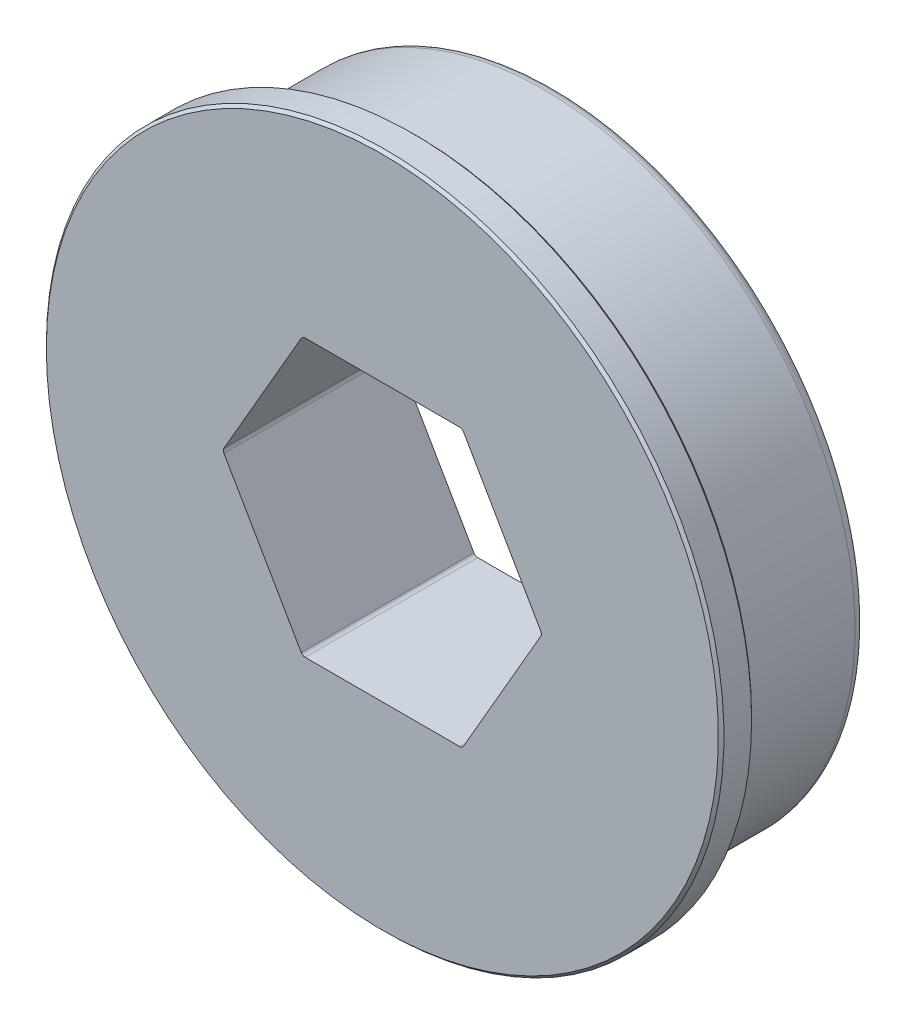
ISO-10303-21;
HEADER;
FILE_DESCRIPTION(('STEP AP214'),'2;1');
FILE_NAME('part.step','',(''),(''),'','','');
FILE_SCHEMA(('AUTOMOTIVE_DESIGN { 1 0 10303 214 1 1 1 1 }'));
ENDSEC;
DATA;
#1=APPLICATION_CONTEXT('core data for automotive mechanical design processes');
#2=APPLICATION_PROTOCOL_DEFINITION('international standard','automotive_design',2000,#1);
#3=PRODUCT_CONTEXT('',#1,'mechanical');
#4=PRODUCT('Part','Part','',(#3));
#5=PRODUCT_RELATED_PRODUCT_CATEGORY('part','',(#4));
#6=PRODUCT_DEFINITION_FORMATION('','',#4);
#7=PRODUCT_DEFINITION_CONTEXT('part definition',#1,'design');
#8=PRODUCT_DEFINITION('design','',#6,#7);
#9=PRODUCT_DEFINITION_SHAPE('','',#8);
#10=(LENGTH_UNIT() NAMED_UNIT(*) SI_UNIT(.MILLI.,.METRE.));
#11=(NAMED_UNIT(*) PLANE_ANGLE_UNIT() SI_UNIT($,.RADIAN.));
#12=(NAMED_UNIT(*) SI_UNIT($,.STERADIAN.) SOLID_ANGLE_UNIT());
#13=UNCERTAINTY_MEASURE_WITH_UNIT(LENGTH_MEASURE(1.E-05),#10,'distance_accuracy_value','');
#14=(GEOMETRIC_REPRESENTATION_CONTEXT(3) GLOBAL_UNCERTAINTY_ASSIGNED_CONTEXT((#13)) GLOBAL_UNIT_ASSIGNED_CONTEXT((#10,
#11,#12)) REPRESENTATION_CONTEXT('',''));
#15=CARTESIAN_POINT('',(0.,0.,0.));
#16=DIRECTION('',(0.,0.,1.));
#17=DIRECTION('',(1.,0.,0.));
#18=AXIS2_PLACEMENT_3D('',#15,#16,#17);
#19=CARTESIAN_POINT('',(0.,0.,7.92734));
#20=DIRECTION('',(0.,0.,-1.));
#21=DIRECTION('',(-1.,0.,0.));
#22=AXIS2_PLACEMENT_3D('',#19,#20,#21);
#23=CYLINDRICAL_SURFACE('',#22,13.97);
#24=CARTESIAN_POINT('',(0.,0.,6.40333999999999));
#25=DIRECTION('',(0.,0.,-1.));
#26=DIRECTION('',(-1.,0.,0.));
#27=AXIS2_PLACEMENT_3D('',#24,#25,#26);
#28=CIRCLE('',#27,13.97);
#29=CARTESIAN_POINT('',(-13.97,0.,6.40333999999999));
#30=VERTEX_POINT('',#29);
#31=EDGE_CURVE('E256',#30,#30,#28,.F.);
#32=ORIENTED_EDGE('',*,*,#31,.F.);
#33=EDGE_LOOP('',(#32));
#34=FACE_BOUND('',#33,.T.);
#35=CARTESIAN_POINT('',(0.,0.,5.89534));
#36=DIRECTION('',(0.,0.,-1.));
#37=DIRECTION('',(-1.,0.,0.));
#38=AXIS2_PLACEMENT_3D('',#35,#36,#37);
#39=CIRCLE('',#38,13.97);
#40=CARTESIAN_POINT('',(-13.97,0.,5.89534));
#41=VERTEX_POINT('',#40);
#42=EDGE_CURVE('E259',#41,#41,#39,.T.);
#43=ORIENTED_EDGE('',*,*,#42,.F.);
#44=EDGE_LOOP('',(#43));
#45=FACE_BOUND('',#44,.T.);
#46=ADVANCED_FACE('F18',(#34,#45),#23,.T.);
#47=CARTESIAN_POINT('',(14.2875,0.,5.89534));
#48=DIRECTION('',(0.,0.,1.));
#49=DIRECTION('',(1.,0.,0.));
#50=AXIS2_PLACEMENT_3D('',#47,#48,#49);
#51=PLANE('',#50);
#52=CARTESIAN_POINT('',(0.,0.,5.89534));
#53=DIRECTION('',(0.,0.,-1.));
#54=DIRECTION('',(-1.,0.,0.));
#55=AXIS2_PLACEMENT_3D('',#52,#53,#54);
#56=CIRCLE('',#55,14.2875);
#57=CARTESIAN_POINT('',(-14.2875,0.,5.89534));
#58=VERTEX_POINT('',#57);
#59=EDGE_CURVE('E253',#58,#58,#56,.T.);
#60=ORIENTED_EDGE('',*,*,#59,.F.);
#61=EDGE_LOOP('',(#60));
#62=FACE_BOUND('',#61,.T.);
#63=ORIENTED_EDGE('',*,*,#42,.T.);
#64=EDGE_LOOP('',(#63));
#65=FACE_BOUND('',#64,.T.);
#66=ADVANCED_FACE('F376',(#62,#65),#51,.T.);
#67=CARTESIAN_POINT('',(13.97,0.,6.40334));
#68=DIRECTION('',(0.,0.,-1.));
#69=DIRECTION('',(-1.,0.,0.));
#70=AXIS2_PLACEMENT_3D('',#67,#68,#69);
#71=PLANE('',#70);
#72=ORIENTED_EDGE('',*,*,#31,.T.);
#73=EDGE_LOOP('',(#72));
#74=FACE_BOUND('',#73,.T.);
#75=CARTESIAN_POINT('',(0.,0.,6.40334));
#76=DIRECTION('',(0.,0.,1.));
#77=DIRECTION('',(1.,0.,0.));
#78=AXIS2_PLACEMENT_3D('',#75,#76,#77);
#79=CIRCLE('',#78,15.4305);
#80=CARTESIAN_POINT('',(15.4305,0.,6.40334));
#81=VERTEX_POINT('',#80);
#82=EDGE_CURVE('E224',#81,#81,#79,.T.);
#83=ORIENTED_EDGE('',*,*,#82,.F.);
#84=EDGE_LOOP('',(#83));
#85=FACE_BOUND('',#84,.T.);
#86=ADVANCED_FACE('F374',(#74,#85),#71,.T.);
#87=CARTESIAN_POINT('',(0.,0.,7.92734));
#88=DIRECTION('',(0.,0.,-1.));
#89=DIRECTION('',(-1.,0.,0.));
#90=AXIS2_PLACEMENT_3D('',#87,#88,#89);
#91=CYLINDRICAL_SURFACE('',#90,14.2875);
#92=ORIENTED_EDGE('',*,*,#59,.T.);
#93=EDGE_LOOP('',(#92));
#94=FACE_BOUND('',#93,.T.);
#95=CARTESIAN_POINT('',(0.,0.,0.508));
#96=DIRECTION('',(0.,0.,-1.));
#97=DIRECTION('',(-1.,0.,0.));
#98=AXIS2_PLACEMENT_3D('',#95,#96,#97);
#99=CIRCLE('',#98,14.2875);
#100=CARTESIAN_POINT('',(-14.2875,0.,0.508));
#101=VERTEX_POINT('',#100);
#102=EDGE_CURVE('E221',#101,#101,#99,.T.);
#103=ORIENTED_EDGE('',*,*,#102,.F.);
#104=EDGE_LOOP('',(#103));
#105=FACE_BOUND('',#104,.T.);
#106=ADVANCED_FACE('F371',(#94,#105),#91,.T.);
#107=CARTESIAN_POINT('',(0.,0.,6.53034000000001));
#108=DIRECTION('',(0.,0.,1.));
#109=DIRECTION('',(1.,0.,0.));
#110=AXIS2_PLACEMENT_3D('',#107,#108,#109);
#111=CONICAL_SURFACE('',#110,15.5575,0.785398163397465);
#112=CARTESIAN_POINT('',(0.,0.,6.53034000000001));
#113=DIRECTION('',(0.,0.,-1.));
#114=DIRECTION('',(-1.,0.,0.));
#115=AXIS2_PLACEMENT_3D('',#112,#113,#114);
#116=CIRCLE('',#115,15.5575);
#117=CARTESIAN_POINT('',(-15.5575,0.,6.53034000000001));
#118=VERTEX_POINT('',#117);
#119=EDGE_CURVE('E85',#118,#118,#116,.F.);
#120=ORIENTED_EDGE('',*,*,#119,.F.);
#121=EDGE_LOOP('',(#120));
#122=FACE_BOUND('',#121,.T.);
#123=ORIENTED_EDGE('',*,*,#82,.T.);
#124=EDGE_LOOP('',(#123));
#125=FACE_BOUND('',#124,.T.);
#126=ADVANCED_FACE('F206',(#122,#125),#111,.T.);
#127=CARTESIAN_POINT('',(0.,0.,0.508));
#128=DIRECTION('',(0.,0.,-1.));
#129=DIRECTION('',(-1.,0.,0.));
#130=AXIS2_PLACEMENT_3D('',#127,#128,#129);
#131=TOROIDAL_SURFACE('',#130,13.7795,0.508);
#132=ORIENTED_EDGE('',*,*,#102,.T.);
#133=EDGE_LOOP('',(#132));
#134=FACE_BOUND('',#133,.T.);
#135=CARTESIAN_POINT('',(0.,0.,0.));
#136=DIRECTION('',(0.,0.,1.));
#137=DIRECTION('',(-1.,0.,0.));
#138=AXIS2_PLACEMENT_3D('',#135,#136,#137);
#139=CIRCLE('',#138,13.7795);
#140=CARTESIAN_POINT('',(13.7795,0.,0.));
#141=VERTEX_POINT('',#140);
#142=CARTESIAN_POINT('',(-13.7795,0.,0.));
#143=VERTEX_POINT('',#142);
#144=EDGE_CURVE('E244',#141,#143,#139,.F.);
#145=ORIENTED_EDGE('',*,*,#144,.F.);
#146=CARTESIAN_POINT('',(0.,0.,0.));
#147=DIRECTION('',(0.,0.,1.));
#148=DIRECTION('',(1.,0.,0.));
#149=AXIS2_PLACEMENT_3D('',#146,#147,#148);
#150=CIRCLE('',#149,13.7795);
#151=EDGE_CURVE('E154',#143,#141,#150,.F.);
#152=ORIENTED_EDGE('',*,*,#151,.F.);
#153=EDGE_LOOP('',(#145,#152));
#154=FACE_BOUND('',#153,.T.);
#155=ADVANCED_FACE('F200',(#134,#154),#131,.T.);
#156=CARTESIAN_POINT('',(0.,0.,7.92734));
#157=DIRECTION('',(0.,0.,-1.));
#158=DIRECTION('',(-1.,0.,0.));
#159=AXIS2_PLACEMENT_3D('',#156,#157,#158);
#160=CYLINDRICAL_SURFACE('',#159,15.5575);
#161=ORIENTED_EDGE('',*,*,#119,.T.);
#162=EDGE_LOOP('',(#161));
#163=FACE_BOUND('',#162,.T.);
#164=CARTESIAN_POINT('',(0.,0.,7.80034));
#165=DIRECTION('',(0.,0.,-1.));
#166=DIRECTION('',(-1.,0.,0.));
#167=AXIS2_PLACEMENT_3D('',#164,#165,#166);
#168=CIRCLE('',#167,15.5575);
#169=CARTESIAN_POINT('',(-15.5575,0.,7.80034));
#170=VERTEX_POINT('',#169);
#171=EDGE_CURVE('E145',#170,#170,#168,.F.);
#172=ORIENTED_EDGE('',*,*,#171,.F.);
#173=EDGE_LOOP('',(#172));
#174=FACE_BOUND('',#173,.T.);
#175=ADVANCED_FACE('F205',(#163,#174),#160,.T.);
#176=CARTESIAN_POINT('',(-7.09771326930958,0.,7.92734));
#177=DIRECTION('',(0.,0.,1.));
#178=DIRECTION('',(1.,0.,0.));
#179=AXIS2_PLACEMENT_3D('',#176,#177,#178);
#180=CYLINDRICAL_SURFACE('',#179,0.2032);
#181=DIRECTION('',(0.,0.,1.));
#182=VECTOR('',#181,1.);
#183=CARTESIAN_POINT('',(-7.27368963135858,-0.101600000000005,7.92734));
#184=LINE('',#183,#182);
#185=CARTESIAN_POINT('',(-7.27368963135857,-0.101600000000006,7.92734));
#186=VERTEX_POINT('',#185);
#187=CARTESIAN_POINT('',(-7.27368963135857,-0.101600000000005,0.));
#188=VERTEX_POINT('',#187);
#189=EDGE_CURVE('E143',#186,#188,#184,.F.);
#190=ORIENTED_EDGE('',*,*,#189,.T.);
#191=CARTESIAN_POINT('',(-7.09771326930958,0.,0.));
#192=DIRECTION('',(0.,0.,1.));
#193=DIRECTION('',(1.,0.,0.));
#194=AXIS2_PLACEMENT_3D('',#191,#192,#193);
#195=CIRCLE('',#194,0.2032);
#196=CARTESIAN_POINT('',(-7.27368963135857,0.101599999999994,0.));
#197=VERTEX_POINT('',#196);
#198=EDGE_CURVE('E93',#197,#188,#195,.T.);
#199=ORIENTED_EDGE('',*,*,#198,.F.);
#200=DIRECTION('',(0.,0.,1.));
#201=VECTOR('',#200,1.);
#202=CARTESIAN_POINT('',(-7.27368963135857,0.101599999999993,7.92734));
#203=LINE('',#202,#201);
#204=CARTESIAN_POINT('',(-7.27368963135857,0.101599999999994,7.92734));
#205=VERTEX_POINT('',#204);
#206=EDGE_CURVE('E89',#197,#205,#203,.T.);
#207=ORIENTED_EDGE('',*,*,#206,.T.);
#208=CARTESIAN_POINT('',(-7.09771326930958,0.,7.92734));
#209=DIRECTION('',(0.,0.,1.));
#210=DIRECTION('',(1.,0.,0.));
#211=AXIS2_PLACEMENT_3D('',#208,#209,#210);
#212=CIRCLE('',#211,0.2032);
#213=EDGE_CURVE('E73',#186,#205,#212,.F.);
#214=ORIENTED_EDGE('',*,*,#213,.F.);
#215=EDGE_LOOP('',(#190,#199,#207,#214));
#216=FACE_BOUND('',#215,.T.);
#217=ADVANCED_FACE('F90',(#216),#180,.F.);
#218=CARTESIAN_POINT('',(-3.54885663465479,6.14679999999999,7.92734));
#219=DIRECTION('',(0.,0.,1.));
#220=DIRECTION('',(1.,0.,0.));
#221=AXIS2_PLACEMENT_3D('',#218,#219,#220);
#222=CYLINDRICAL_SURFACE('',#221,0.2032);
#223=DIRECTION('',(0.,0.,1.));
#224=VECTOR('',#223,1.);
#225=CARTESIAN_POINT('',(-3.72483299670379,6.24839999999999,7.92734));
#226=LINE('',#225,#224);
#227=CARTESIAN_POINT('',(-3.72483299670379,6.24839999999999,7.92734));
#228=VERTEX_POINT('',#227);
#229=CARTESIAN_POINT('',(-3.72483299670378,6.24839999999999,0.));
#230=VERTEX_POINT('',#229);
#231=EDGE_CURVE('E103',#228,#230,#226,.F.);
#232=ORIENTED_EDGE('',*,*,#231,.T.);
#233=CARTESIAN_POINT('',(-3.54885663465479,6.14679999999999,0.));
#234=DIRECTION('',(0.,0.,1.));
#235=DIRECTION('',(1.,0.,0.));
#236=AXIS2_PLACEMENT_3D('',#233,#234,#235);
#237=CIRCLE('',#236,0.2032);
#238=CARTESIAN_POINT('',(-3.54885663465479,6.34999999999999,0.));
#239=VERTEX_POINT('',#238);
#240=EDGE_CURVE('E231',#239,#230,#237,.T.);
#241=ORIENTED_EDGE('',*,*,#240,.F.);
#242=DIRECTION('',(0.,0.,1.));
#243=VECTOR('',#242,1.);
#244=CARTESIAN_POINT('',(-3.54885663465479,6.34999999999999,7.92734));
#245=LINE('',#244,#243);
#246=CARTESIAN_POINT('',(-3.54885663465479,6.34999999999999,7.92734));
#247=VERTEX_POINT('',#246);
#248=EDGE_CURVE('E97',#239,#247,#245,.T.);
#249=ORIENTED_EDGE('',*,*,#248,.T.);
#250=CARTESIAN_POINT('',(-3.54885663465479,6.14679999999999,7.92734));
#251=DIRECTION('',(0.,0.,1.));
#252=DIRECTION('',(1.,0.,0.));
#253=AXIS2_PLACEMENT_3D('',#250,#251,#252);
#254=CIRCLE('',#253,0.2032);
#255=EDGE_CURVE('E84',#228,#247,#254,.F.);
#256=ORIENTED_EDGE('',*,*,#255,.F.);
#257=EDGE_LOOP('',(#232,#241,#249,#256));
#258=FACE_BOUND('',#257,.T.);
#259=ADVANCED_FACE('F321',(#258),#222,.F.);
#260=CARTESIAN_POINT('',(3.5488566346548,6.1468,7.92734));
#261=DIRECTION('',(0.,0.,1.));
#262=DIRECTION('',(1.,0.,0.));
#263=AXIS2_PLACEMENT_3D('',#260,#261,#262);
#264=CYLINDRICAL_SURFACE('',#263,0.2032);
#265=DIRECTION('',(0.,0.,1.));
#266=VECTOR('',#265,1.);
#267=CARTESIAN_POINT('',(3.5488566346548,6.35,7.92734));
#268=LINE('',#267,#266);
#269=CARTESIAN_POINT('',(3.5488566346548,6.34999999999999,7.92734));
#270=VERTEX_POINT('',#269);
#271=CARTESIAN_POINT('',(3.5488566346548,6.35,0.));
#272=VERTEX_POINT('',#271);
#273=EDGE_CURVE('E136',#270,#272,#268,.F.);
#274=ORIENTED_EDGE('',*,*,#273,.T.);
#275=CARTESIAN_POINT('',(3.5488566346548,6.1468,0.));
#276=DIRECTION('',(0.,0.,1.));
#277=DIRECTION('',(1.,0.,0.));
#278=AXIS2_PLACEMENT_3D('',#275,#276,#277);
#279=CIRCLE('',#278,0.2032);
#280=CARTESIAN_POINT('',(3.7248329967038,6.2484,0.));
#281=VERTEX_POINT('',#280);
#282=EDGE_CURVE('E234',#281,#272,#279,.T.);
#283=ORIENTED_EDGE('',*,*,#282,.F.);
#284=DIRECTION('',(0.,0.,1.));
#285=VECTOR('',#284,1.);
#286=CARTESIAN_POINT('',(3.72483299670379,6.2484,7.92734));
#287=LINE('',#286,#285);
#288=CARTESIAN_POINT('',(3.72483299670379,6.2484,7.92734));
#289=VERTEX_POINT('',#288);
#290=EDGE_CURVE('E126',#281,#289,#287,.T.);
#291=ORIENTED_EDGE('',*,*,#290,.T.);
#292=CARTESIAN_POINT('',(3.5488566346548,6.1468,7.92734));
#293=DIRECTION('',(0.,0.,1.));
#294=DIRECTION('',(1.,0.,0.));
#295=AXIS2_PLACEMENT_3D('',#292,#293,#294);
#296=CIRCLE('',#295,0.2032);
#297=EDGE_CURVE('E248',#270,#289,#296,.F.);
#298=ORIENTED_EDGE('',*,*,#297,.F.);
#299=EDGE_LOOP('',(#274,#283,#291,#298));
#300=FACE_BOUND('',#299,.T.);
#301=ADVANCED_FACE('F327',(#300),#264,.F.);
#302=CARTESIAN_POINT('',(7.09771326930959,0.,7.92734));
#303=DIRECTION('',(0.,0.,1.));
#304=DIRECTION('',(1.,0.,0.));
#305=AXIS2_PLACEMENT_3D('',#302,#303,#304);
#306=CYLINDRICAL_SURFACE('',#305,0.2032);
#307=CARTESIAN_POINT('',(7.09771326930959,0.,0.));
#308=DIRECTION('',(0.,0.,1.));
#309=DIRECTION('',(1.,0.,0.));
#310=AXIS2_PLACEMENT_3D('',#307,#308,#309);
#311=CIRCLE('',#310,0.2032);
#312=CARTESIAN_POINT('',(7.27368963135859,-0.101600000000005,0.));
#313=VERTEX_POINT('',#312);
#314=CARTESIAN_POINT('',(7.27368963135859,0.101599999999995,0.));
#315=VERTEX_POINT('',#314);
#316=EDGE_CURVE('E237',#313,#315,#311,.T.);
#317=ORIENTED_EDGE('',*,*,#316,.F.);
#318=DIRECTION('',(0.,0.,1.));
#319=VECTOR('',#318,1.);
#320=CARTESIAN_POINT('',(7.27368963135859,-0.101600000000005,7.92734));
#321=LINE('',#320,#319);
#322=CARTESIAN_POINT('',(7.27368963135859,-0.101600000000005,7.92734));
#323=VERTEX_POINT('',#322);
#324=EDGE_CURVE('E119',#313,#323,#321,.T.);
#325=ORIENTED_EDGE('',*,*,#324,.T.);
#326=CARTESIAN_POINT('',(7.09771326930959,0.,7.92734));
#327=DIRECTION('',(0.,0.,1.));
#328=DIRECTION('',(1.,0.,0.));
#329=AXIS2_PLACEMENT_3D('',#326,#327,#328);
#330=CIRCLE('',#329,0.2032);
#331=CARTESIAN_POINT('',(7.27368963135859,0.101599999999995,7.92734));
#332=VERTEX_POINT('',#331);
#333=EDGE_CURVE('E246',#332,#323,#330,.F.);
#334=ORIENTED_EDGE('',*,*,#333,.F.);
#335=DIRECTION('',(0.,0.,1.));
#336=VECTOR('',#335,1.);
#337=CARTESIAN_POINT('',(7.27368963135859,0.101599999999995,7.92734));
#338=LINE('',#337,#336);
#339=EDGE_CURVE('E130',#332,#315,#338,.F.);
#340=ORIENTED_EDGE('',*,*,#339,.T.);
#341=EDGE_LOOP('',(#317,#325,#334,#340));
#342=FACE_BOUND('',#341,.T.);
#343=ADVANCED_FACE('F308',(#342),#306,.F.);
#344=CARTESIAN_POINT('',(-3.54885663465478,-6.14680000000001,7.92734));
#345=DIRECTION('',(0.,0.,1.));
#346=DIRECTION('',(1.,0.,0.));
#347=AXIS2_PLACEMENT_3D('',#344,#345,#346);
#348=CYLINDRICAL_SURFACE('',#347,0.2032);
#349=DIRECTION('',(0.,0.,-1.));
#350=VECTOR('',#349,1.);
#351=CARTESIAN_POINT('',(-3.54885663465478,-6.35000000000001,7.92734));
#352=LINE('',#351,#350);
#353=CARTESIAN_POINT('',(-3.54885663465478,-6.35000000000001,7.92734));
#354=VERTEX_POINT('',#353);
#355=CARTESIAN_POINT('',(-3.54885663465478,-6.35000000000001,0.));
#356=VERTEX_POINT('',#355);
#357=EDGE_CURVE('E117',#354,#356,#352,.T.);
#358=ORIENTED_EDGE('',*,*,#357,.T.);
#359=CARTESIAN_POINT('',(-3.54885663465478,-6.14680000000001,0.));
#360=DIRECTION('',(0.,0.,1.));
#361=DIRECTION('',(1.,0.,0.));
#362=AXIS2_PLACEMENT_3D('',#359,#360,#361);
#363=CIRCLE('',#362,0.2032);
#364=CARTESIAN_POINT('',(-3.72483299670378,-6.24840000000001,0.));
#365=VERTEX_POINT('',#364);
#366=EDGE_CURVE('E240',#365,#356,#363,.T.);
#367=ORIENTED_EDGE('',*,*,#366,.F.);
#368=DIRECTION('',(0.,0.,1.));
#369=VECTOR('',#368,1.);
#370=CARTESIAN_POINT('',(-3.72483299670378,-6.24840000000001,7.92734));
#371=LINE('',#370,#369);
#372=CARTESIAN_POINT('',(-3.72483299670378,-6.24840000000001,7.92734));
#373=VERTEX_POINT('',#372);
#374=EDGE_CURVE('E140',#365,#373,#371,.T.);
#375=ORIENTED_EDGE('',*,*,#374,.T.);
#376=CARTESIAN_POINT('',(-3.54885663465478,-6.14680000000001,7.92734));
#377=DIRECTION('',(0.,0.,1.));
#378=DIRECTION('',(1.,0.,0.));
#379=AXIS2_PLACEMENT_3D('',#376,#377,#378);
#380=CIRCLE('',#379,0.2032);
#381=EDGE_CURVE('E38',#354,#373,#380,.F.);
#382=ORIENTED_EDGE('',*,*,#381,.F.);
#383=EDGE_LOOP('',(#358,#367,#375,#382));
#384=FACE_BOUND('',#383,.T.);
#385=ADVANCED_FACE('F171',(#384),#348,.F.);
#386=CARTESIAN_POINT('',(0.,0.,0.));
#387=DIRECTION('',(0.,0.,-1.));
#388=DIRECTION('',(-1.,0.,0.));
#389=AXIS2_PLACEMENT_3D('',#386,#387,#388);
#390=PLANE('',#389);
#391=DIRECTION('',(-1.,0.,0.));
#392=VECTOR('',#391,1.);
#393=CARTESIAN_POINT('',(-3.66617420935412,6.34999999999999,0.));
#394=LINE('',#393,#392);
#395=EDGE_CURVE('E133',#272,#239,#394,.T.);
#396=ORIENTED_EDGE('',*,*,#395,.T.);
#397=ORIENTED_EDGE('',*,*,#240,.T.);
#398=DIRECTION('',(-0.5,-0.866025403784439,0.));
#399=VECTOR('',#398,1.);
#400=CARTESIAN_POINT('',(-7.33234841870824,0.,0.));
#401=LINE('',#400,#399);
#402=EDGE_CURVE('E98',#230,#197,#401,.T.);
#403=ORIENTED_EDGE('',*,*,#402,.T.);
#404=ORIENTED_EDGE('',*,*,#198,.T.);
#405=DIRECTION('',(0.5,-0.866025403784439,0.));
#406=VECTOR('',#405,1.);
#407=CARTESIAN_POINT('',(-3.66617420935411,-6.35000000000001,0.));
#408=LINE('',#407,#406);
#409=EDGE_CURVE('E142',#188,#365,#408,.T.);
#410=ORIENTED_EDGE('',*,*,#409,.T.);
#411=ORIENTED_EDGE('',*,*,#366,.T.);
#412=DIRECTION('',(1.,0.,0.));
#413=VECTOR('',#412,1.);
#414=CARTESIAN_POINT('',(3.66617420935413,-6.35000000000001,0.));
#415=LINE('',#414,#413);
#416=CARTESIAN_POINT('',(3.5488566346548,-6.35000000000001,0.));
#417=VERTEX_POINT('',#416);
#418=EDGE_CURVE('E116',#356,#417,#415,.T.);
#419=ORIENTED_EDGE('',*,*,#418,.T.);
#420=CARTESIAN_POINT('',(3.5488566346548,-6.14680000000001,0.));
#421=DIRECTION('',(0.,0.,1.));
#422=DIRECTION('',(1.,0.,0.));
#423=AXIS2_PLACEMENT_3D('',#420,#421,#422);
#424=CIRCLE('',#423,0.2032);
#425=CARTESIAN_POINT('',(3.7248329967038,-6.24840000000001,0.));
#426=VERTEX_POINT('',#425);
#427=EDGE_CURVE('E228',#417,#426,#424,.T.);
#428=ORIENTED_EDGE('',*,*,#427,.T.);
#429=DIRECTION('',(0.5,0.866025403784439,0.));
#430=VECTOR('',#429,1.);
#431=CARTESIAN_POINT('',(7.33234841870825,0.,0.));
#432=LINE('',#431,#430);
#433=EDGE_CURVE('E122',#426,#313,#432,.T.);
#434=ORIENTED_EDGE('',*,*,#433,.T.);
#435=ORIENTED_EDGE('',*,*,#316,.T.);
#436=DIRECTION('',(-0.5,0.866025403784439,0.));
#437=VECTOR('',#436,1.);
#438=CARTESIAN_POINT('',(3.66617420935413,6.35,0.));
#439=LINE('',#438,#437);
#440=EDGE_CURVE('E129',#315,#281,#439,.T.);
#441=ORIENTED_EDGE('',*,*,#440,.T.);
#442=ORIENTED_EDGE('',*,*,#282,.T.);
#443=EDGE_LOOP('',(#396,#397,#403,#404,#410,#411,#419,#428,#434,#435,#441,#442));
#444=FACE_BOUND('',#443,.T.);
#445=ORIENTED_EDGE('',*,*,#151,.T.);
#446=ORIENTED_EDGE('',*,*,#144,.T.);
#447=EDGE_LOOP('',(#445,#446));
#448=FACE_BOUND('',#447,.T.);
#449=ADVANCED_FACE('F160',(#444,#448),#390,.T.);
#450=CARTESIAN_POINT('',(3.5488566346548,-6.14680000000001,7.92734));
#451=DIRECTION('',(0.,0.,1.));
#452=DIRECTION('',(1.,0.,0.));
#453=AXIS2_PLACEMENT_3D('',#450,#451,#452);
#454=CYLINDRICAL_SURFACE('',#453,0.2032);
#455=DIRECTION('',(0.,0.,1.));
#456=VECTOR('',#455,1.);
#457=CARTESIAN_POINT('',(3.7248329967038,-6.2484,7.92734));
#458=LINE('',#457,#456);
#459=CARTESIAN_POINT('',(3.7248329967038,-6.2484,7.92734));
#460=VERTEX_POINT('',#459);
#461=EDGE_CURVE('E123',#460,#426,#458,.F.);
#462=ORIENTED_EDGE('',*,*,#461,.T.);
#463=ORIENTED_EDGE('',*,*,#427,.F.);
#464=DIRECTION('',(0.,0.,-1.));
#465=VECTOR('',#464,1.);
#466=CARTESIAN_POINT('',(3.5488566346548,-6.35000000000001,7.92734));
#467=LINE('',#466,#465);
#468=CARTESIAN_POINT('',(3.5488566346548,-6.35000000000001,7.92734));
#469=VERTEX_POINT('',#468);
#470=EDGE_CURVE('E113',#417,#469,#467,.F.);
#471=ORIENTED_EDGE('',*,*,#470,.T.);
#472=CARTESIAN_POINT('',(3.5488566346548,-6.14680000000001,7.92734));
#473=DIRECTION('',(0.,0.,1.));
#474=DIRECTION('',(1.,0.,0.));
#475=AXIS2_PLACEMENT_3D('',#472,#473,#474);
#476=CIRCLE('',#475,0.2032);
#477=EDGE_CURVE('E195',#460,#469,#476,.F.);
#478=ORIENTED_EDGE('',*,*,#477,.F.);
#479=EDGE_LOOP('',(#462,#463,#471,#478));
#480=FACE_BOUND('',#479,.T.);
#481=ADVANCED_FACE('F170',(#480),#454,.F.);
#482=CARTESIAN_POINT('',(0.,0.,7.80034));
#483=DIRECTION('',(0.,0.,-1.));
#484=DIRECTION('',(-1.,0.,0.));
#485=AXIS2_PLACEMENT_3D('',#482,#483,#484);
#486=CONICAL_SURFACE('',#485,15.5575,0.785398163397442);
#487=ORIENTED_EDGE('',*,*,#171,.T.);
#488=EDGE_LOOP('',(#487));
#489=FACE_BOUND('',#488,.T.);
#490=CARTESIAN_POINT('',(0.,0.,7.92734));
#491=DIRECTION('',(0.,0.,-1.));
#492=DIRECTION('',(-1.,0.,0.));
#493=AXIS2_PLACEMENT_3D('',#490,#491,#492);
#494=CIRCLE('',#493,15.4305);
#495=CARTESIAN_POINT('',(-15.4305,0.,7.92734));
#496=VERTEX_POINT('',#495);
#497=EDGE_CURVE('E109',#496,#496,#494,.F.);
#498=ORIENTED_EDGE('',*,*,#497,.F.);
#499=EDGE_LOOP('',(#498));
#500=FACE_BOUND('',#499,.T.);
#501=ADVANCED_FACE('F352',(#489,#500),#486,.T.);
#502=CARTESIAN_POINT('',(-3.66617420935411,-6.35000000000001,7.92734));
#503=DIRECTION('',(-0.866025403784439,-0.5,0.));
#504=DIRECTION('',(0.5,-0.866025403784439,0.));
#505=AXIS2_PLACEMENT_3D('',#502,#503,#504);
#506=PLANE('',#505);
#507=ORIENTED_EDGE('',*,*,#374,.F.);
#508=ORIENTED_EDGE('',*,*,#409,.F.);
#509=ORIENTED_EDGE('',*,*,#189,.F.);
#510=DIRECTION('',(-0.5,0.866025403784438,0.));
#511=VECTOR('',#510,1.);
#512=CARTESIAN_POINT('',(-3.72483299670378,-6.24840000000001,7.92734));
#513=LINE('',#512,#511);
#514=EDGE_CURVE('E83',#373,#186,#513,.T.);
#515=ORIENTED_EDGE('',*,*,#514,.F.);
#516=EDGE_LOOP('',(#507,#508,#509,#515));
#517=FACE_BOUND('',#516,.T.);
#518=ADVANCED_FACE('F317',(#517),#506,.F.);
#519=CARTESIAN_POINT('',(-7.33234841870824,0.,7.92734));
#520=DIRECTION('',(-0.866025403784439,0.5,0.));
#521=DIRECTION('',(-0.5,-0.866025403784439,0.));
#522=AXIS2_PLACEMENT_3D('',#519,#520,#521);
#523=PLANE('',#522);
#524=ORIENTED_EDGE('',*,*,#206,.F.);
#525=ORIENTED_EDGE('',*,*,#402,.F.);
#526=ORIENTED_EDGE('',*,*,#231,.F.);
#527=DIRECTION('',(0.5,0.866025403784439,0.));
#528=VECTOR('',#527,1.);
#529=CARTESIAN_POINT('',(-7.27368963135857,0.101599999999993,7.92734));
#530=LINE('',#529,#528);
#531=EDGE_CURVE('E81',#205,#228,#530,.T.);
#532=ORIENTED_EDGE('',*,*,#531,.F.);
#533=EDGE_LOOP('',(#524,#525,#526,#532));
#534=FACE_BOUND('',#533,.T.);
#535=ADVANCED_FACE('F101',(#534),#523,.F.);
#536=CARTESIAN_POINT('',(-3.66617420935412,6.34999999999999,7.92734));
#537=DIRECTION('',(0.,1.,0.));
#538=DIRECTION('',(-1.,0.,0.));
#539=AXIS2_PLACEMENT_3D('',#536,#537,#538);
#540=PLANE('',#539);
#541=ORIENTED_EDGE('',*,*,#273,.F.);
#542=DIRECTION('',(1.,0.,0.));
#543=VECTOR('',#542,1.);
#544=CARTESIAN_POINT('',(15.5575,6.34999999999999,7.92734));
#545=LINE('',#544,#543);
#546=EDGE_CURVE('E104',#247,#270,#545,.T.);
#547=ORIENTED_EDGE('',*,*,#546,.F.);
#548=ORIENTED_EDGE('',*,*,#248,.F.);
#549=ORIENTED_EDGE('',*,*,#395,.F.);
#550=EDGE_LOOP('',(#541,#547,#548,#549));
#551=FACE_BOUND('',#550,.T.);
#552=ADVANCED_FACE('F325',(#551),#540,.F.);
#553=CARTESIAN_POINT('',(3.66617420935413,6.35,7.92734));
#554=DIRECTION('',(0.866025403784439,0.5,0.));
#555=DIRECTION('',(-0.5,0.866025403784439,0.));
#556=AXIS2_PLACEMENT_3D('',#553,#554,#555);
#557=PLANE('',#556);
#558=ORIENTED_EDGE('',*,*,#290,.F.);
#559=ORIENTED_EDGE('',*,*,#440,.F.);
#560=ORIENTED_EDGE('',*,*,#339,.F.);
#561=DIRECTION('',(0.5,-0.866025403784438,0.));
#562=VECTOR('',#561,1.);
#563=CARTESIAN_POINT('',(3.72483299670379,6.2484,7.92734));
#564=LINE('',#563,#562);
#565=EDGE_CURVE('E107',#289,#332,#564,.T.);
#566=ORIENTED_EDGE('',*,*,#565,.F.);
#567=EDGE_LOOP('',(#558,#559,#560,#566));
#568=FACE_BOUND('',#567,.T.);
#569=ADVANCED_FACE('F314',(#568),#557,.F.);
#570=CARTESIAN_POINT('',(7.33234841870825,0.,7.92734));
#571=DIRECTION('',(0.866025403784439,-0.5,0.));
#572=DIRECTION('',(0.5,0.866025403784439,0.));
#573=AXIS2_PLACEMENT_3D('',#570,#571,#572);
#574=PLANE('',#573);
#575=ORIENTED_EDGE('',*,*,#324,.F.);
#576=ORIENTED_EDGE('',*,*,#433,.F.);
#577=ORIENTED_EDGE('',*,*,#461,.F.);
#578=DIRECTION('',(-0.5,-0.866025403784439,0.));
#579=VECTOR('',#578,1.);
#580=CARTESIAN_POINT('',(7.27368963135859,-0.101600000000005,7.92734));
#581=LINE('',#580,#579);
#582=EDGE_CURVE('E29',#323,#460,#581,.T.);
#583=ORIENTED_EDGE('',*,*,#582,.F.);
#584=EDGE_LOOP('',(#575,#576,#577,#583));
#585=FACE_BOUND('',#584,.T.);
#586=ADVANCED_FACE('F305',(#585),#574,.F.);
#587=CARTESIAN_POINT('',(3.66617420935413,-6.35000000000001,7.92734));
#588=DIRECTION('',(0.,-1.,0.));
#589=DIRECTION('',(0.,0.,-1.));
#590=AXIS2_PLACEMENT_3D('',#587,#588,#589);
#591=PLANE('',#590);
#592=ORIENTED_EDGE('',*,*,#470,.F.);
#593=ORIENTED_EDGE('',*,*,#418,.F.);
#594=ORIENTED_EDGE('',*,*,#357,.F.);
#595=DIRECTION('',(1.,0.,0.));
#596=VECTOR('',#595,1.);
#597=CARTESIAN_POINT('',(15.5575,-6.35000000000001,7.92734));
#598=LINE('',#597,#596);
#599=EDGE_CURVE('E11',#469,#354,#598,.F.);
#600=ORIENTED_EDGE('',*,*,#599,.F.);
#601=EDGE_LOOP('',(#592,#593,#594,#600));
#602=FACE_BOUND('',#601,.T.);
#603=ADVANCED_FACE('F297',(#602),#591,.F.);
#604=CARTESIAN_POINT('',(15.5575,0.,7.92734));
#605=DIRECTION('',(0.,0.,1.));
#606=DIRECTION('',(1.,0.,0.));
#607=AXIS2_PLACEMENT_3D('',#604,#605,#606);
#608=PLANE('',#607);
#609=ORIENTED_EDGE('',*,*,#599,.T.);
#610=ORIENTED_EDGE('',*,*,#381,.T.);
#611=ORIENTED_EDGE('',*,*,#514,.T.);
#612=ORIENTED_EDGE('',*,*,#213,.T.);
#613=ORIENTED_EDGE('',*,*,#531,.T.);
#614=ORIENTED_EDGE('',*,*,#255,.T.);
#615=ORIENTED_EDGE('',*,*,#546,.T.);
#616=ORIENTED_EDGE('',*,*,#297,.T.);
#617=ORIENTED_EDGE('',*,*,#565,.T.);
#618=ORIENTED_EDGE('',*,*,#333,.T.);
#619=ORIENTED_EDGE('',*,*,#582,.T.);
#620=ORIENTED_EDGE('',*,*,#477,.T.);
#621=EDGE_LOOP('',(#609,#610,#611,#612,#613,#614,#615,#616,#617,#618,#619,#620));
#622=FACE_BOUND('',#621,.T.);
#623=ORIENTED_EDGE('',*,*,#497,.T.);
#624=EDGE_LOOP('',(#623));
#625=FACE_BOUND('',#624,.T.);
#626=ADVANCED_FACE('F78',(#622,#625),#608,.T.);
#627=CLOSED_SHELL('',(#46,#66,#86,#106,#126,#155,#175,#217,#259,#301,#343,#385,#449,#481,#501,
#518,#535,#552,#569,#586,#603,#626));
#628=MANIFOLD_SOLID_BREP('B1',#627);
#629=ADVANCED_BREP_SHAPE_REPRESENTATION('',(#18,#628),#14);
#630=SHAPE_DEFINITION_REPRESENTATION(#9,#629);
ENDSEC;
END-ISO-10303-21;
